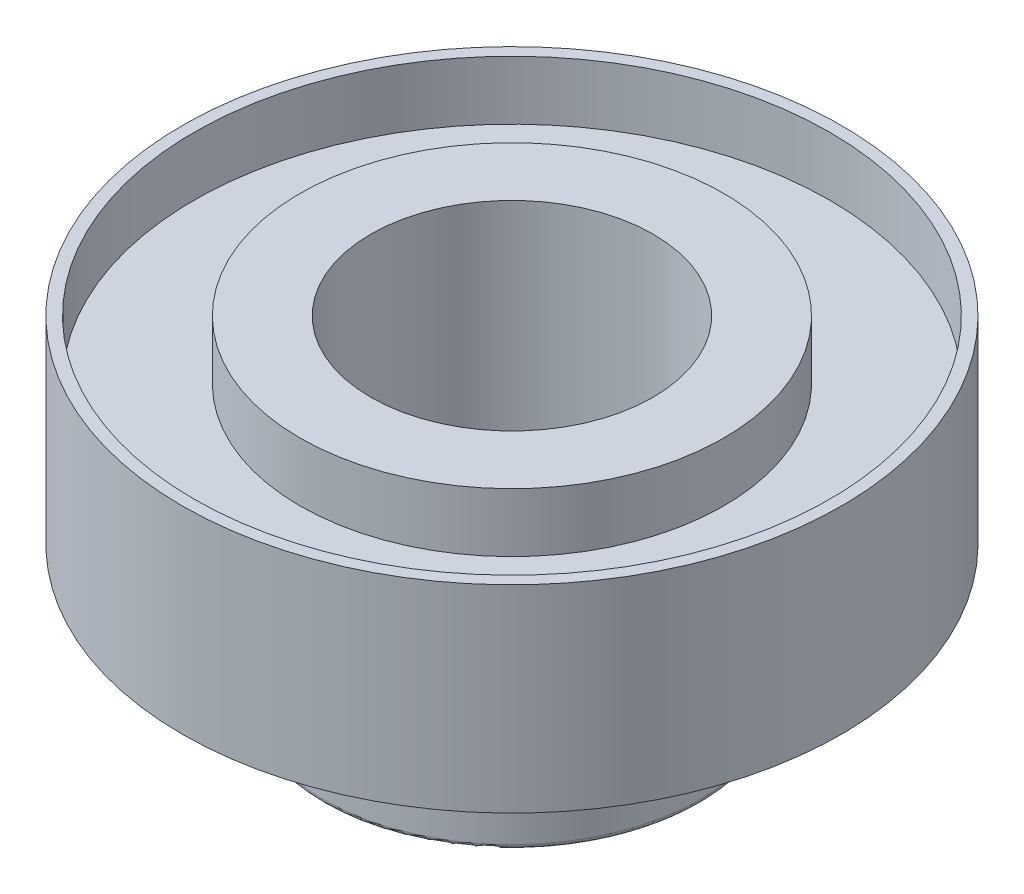
ISO-10303-21;
HEADER;
FILE_DESCRIPTION(('STEP AP214'),'2;1');
FILE_NAME('part.step','',(''),(''),'','','');
FILE_SCHEMA(('AUTOMOTIVE_DESIGN { 1 0 10303 214 1 1 1 1 }'));
ENDSEC;
DATA;
#1=APPLICATION_CONTEXT('core data for automotive mechanical design processes');
#2=APPLICATION_PROTOCOL_DEFINITION('international standard','automotive_design',2000,#1);
#3=PRODUCT_CONTEXT('',#1,'mechanical');
#4=PRODUCT('Part','Part','',(#3));
#5=PRODUCT_RELATED_PRODUCT_CATEGORY('part','',(#4));
#6=PRODUCT_DEFINITION_FORMATION('','',#4);
#7=PRODUCT_DEFINITION_CONTEXT('part definition',#1,'design');
#8=PRODUCT_DEFINITION('design','',#6,#7);
#9=PRODUCT_DEFINITION_SHAPE('','',#8);
#10=(LENGTH_UNIT() NAMED_UNIT(*) SI_UNIT(.MILLI.,.METRE.));
#11=(NAMED_UNIT(*) PLANE_ANGLE_UNIT() SI_UNIT($,.RADIAN.));
#12=(NAMED_UNIT(*) SI_UNIT($,.STERADIAN.) SOLID_ANGLE_UNIT());
#13=UNCERTAINTY_MEASURE_WITH_UNIT(LENGTH_MEASURE(1.E-05),#10,'distance_accuracy_value','');
#14=(GEOMETRIC_REPRESENTATION_CONTEXT(3) GLOBAL_UNCERTAINTY_ASSIGNED_CONTEXT((#13)) GLOBAL_UNIT_ASSIGNED_CONTEXT((#10,
#11,#12)) REPRESENTATION_CONTEXT('',''));
#15=CARTESIAN_POINT('',(0.,0.,0.));
#16=DIRECTION('',(0.,0.,1.));
#17=DIRECTION('',(1.,0.,0.));
#18=AXIS2_PLACEMENT_3D('',#15,#16,#17);
#19=CARTESIAN_POINT('',(0.,0.,0.));
#20=DIRECTION('',(0.,1.,0.));
#21=DIRECTION('',(0.,0.,1.));
#22=AXIS2_PLACEMENT_3D('',#19,#20,#21);
#23=PLANE('',#22);
#24=CARTESIAN_POINT('',(0.,0.,0.));
#25=DIRECTION('',(0.,1.,0.));
#26=DIRECTION('',(0.,0.,1.));
#27=AXIS2_PLACEMENT_3D('',#24,#25,#26);
#28=CIRCLE('',#27,7.);
#29=CARTESIAN_POINT('',(0.,0.,7.));
#30=VERTEX_POINT('',#29);
#31=EDGE_CURVE('E58',#30,#30,#28,.T.);
#32=ORIENTED_EDGE('',*,*,#31,.F.);
#33=EDGE_LOOP('',(#32));
#34=FACE_BOUND('',#33,.T.);
#35=CARTESIAN_POINT('',(0.,0.,0.));
#36=DIRECTION('',(0.,1.,0.));
#37=DIRECTION('',(0.,0.,1.));
#38=AXIS2_PLACEMENT_3D('',#35,#36,#37);
#39=CIRCLE('',#38,4.);
#40=CARTESIAN_POINT('',(0.,0.,4.));
#41=VERTEX_POINT('',#40);
#42=EDGE_CURVE('E50',#41,#41,#39,.F.);
#43=ORIENTED_EDGE('',*,*,#42,.F.);
#44=EDGE_LOOP('',(#43));
#45=FACE_BOUND('',#44,.T.);
#46=ADVANCED_FACE('F37',(#34,#45),#23,.F.);
#47=CARTESIAN_POINT('',(0.,4.2,0.));
#48=DIRECTION('',(0.,1.,0.));
#49=DIRECTION('',(0.,0.,1.));
#50=AXIS2_PLACEMENT_3D('',#47,#48,#49);
#51=PLANE('',#50);
#52=CARTESIAN_POINT('',(0.,4.2,0.));
#53=DIRECTION('',(0.,1.,0.));
#54=DIRECTION('',(0.,0.,1.));
#55=AXIS2_PLACEMENT_3D('',#52,#53,#54);
#56=CIRCLE('',#55,3.);
#57=CARTESIAN_POINT('',(0.,4.2,3.));
#58=VERTEX_POINT('',#57);
#59=EDGE_CURVE('E62',#58,#58,#56,.T.);
#60=ORIENTED_EDGE('',*,*,#59,.F.);
#61=EDGE_LOOP('',(#60));
#62=FACE_BOUND('',#61,.T.);
#63=CARTESIAN_POINT('',(0.,4.2,0.));
#64=DIRECTION('',(0.,1.,0.));
#65=DIRECTION('',(0.,0.,1.));
#66=AXIS2_PLACEMENT_3D('',#63,#64,#65);
#67=CIRCLE('',#66,4.5);
#68=CARTESIAN_POINT('',(0.,4.2,4.5));
#69=VERTEX_POINT('',#68);
#70=EDGE_CURVE('E78',#69,#69,#67,.T.);
#71=ORIENTED_EDGE('',*,*,#70,.T.);
#72=EDGE_LOOP('',(#71));
#73=FACE_BOUND('',#72,.T.);
#74=ADVANCED_FACE('F106',(#62,#73),#51,.T.);
#75=CARTESIAN_POINT('',(0.,4.2,0.));
#76=DIRECTION('',(0.,-1.,0.));
#77=DIRECTION('',(0.,0.,-1.));
#78=AXIS2_PLACEMENT_3D('',#75,#76,#77);
#79=CYLINDRICAL_SURFACE('',#78,7.);
#80=CARTESIAN_POINT('',(0.,4.2,0.));
#81=DIRECTION('',(0.,1.,0.));
#82=DIRECTION('',(0.,0.,1.));
#83=AXIS2_PLACEMENT_3D('',#80,#81,#82);
#84=CIRCLE('',#83,7.);
#85=CARTESIAN_POINT('',(0.,4.2,7.));
#86=VERTEX_POINT('',#85);
#87=EDGE_CURVE('E55',#86,#86,#84,.T.);
#88=ORIENTED_EDGE('',*,*,#87,.F.);
#89=EDGE_LOOP('',(#88));
#90=FACE_BOUND('',#89,.T.);
#91=ORIENTED_EDGE('',*,*,#31,.T.);
#92=EDGE_LOOP('',(#91));
#93=FACE_BOUND('',#92,.T.);
#94=ADVANCED_FACE('F112',(#90,#93),#79,.T.);
#95=CARTESIAN_POINT('',(0.,4.2,0.));
#96=DIRECTION('',(0.,1.,0.));
#97=DIRECTION('',(0.,0.,1.));
#98=AXIS2_PLACEMENT_3D('',#95,#96,#97);
#99=CIRCLE('',#98,6.75);
#100=CARTESIAN_POINT('',(0.,4.2,6.75));
#101=VERTEX_POINT('',#100);
#102=EDGE_CURVE('E70',#101,#101,#99,.T.);
#103=ORIENTED_EDGE('',*,*,#102,.F.);
#104=EDGE_LOOP('',(#103));
#105=FACE_BOUND('',#104,.T.);
#106=ORIENTED_EDGE('',*,*,#87,.T.);
#107=EDGE_LOOP('',(#106));
#108=FACE_BOUND('',#107,.T.);
#109=ADVANCED_FACE('F115',(#105,#108),#51,.T.);
#110=CARTESIAN_POINT('',(0.,0.,0.));
#111=DIRECTION('',(0.,1.,0.));
#112=DIRECTION('',(0.,0.,1.));
#113=AXIS2_PLACEMENT_3D('',#110,#111,#112);
#114=CYLINDRICAL_SURFACE('',#113,3.);
#115=ORIENTED_EDGE('',*,*,#59,.T.);
#116=EDGE_LOOP('',(#115));
#117=FACE_BOUND('',#116,.T.);
#118=CARTESIAN_POINT('',(0.,-2.8,0.));
#119=DIRECTION('',(0.,-1.,0.));
#120=DIRECTION('',(0.,0.,-1.));
#121=AXIS2_PLACEMENT_3D('',#118,#119,#120);
#122=CIRCLE('',#121,3.);
#123=CARTESIAN_POINT('',(0.,-2.8,-3.));
#124=VERTEX_POINT('',#123);
#125=EDGE_CURVE('E82',#124,#124,#122,.T.);
#126=ORIENTED_EDGE('',*,*,#125,.T.);
#127=EDGE_LOOP('',(#126));
#128=FACE_BOUND('',#127,.T.);
#129=ADVANCED_FACE('F90',(#117,#128),#114,.F.);
#130=CARTESIAN_POINT('',(0.,2.95,0.));
#131=DIRECTION('',(0.,1.,0.));
#132=DIRECTION('',(0.,0.,1.));
#133=AXIS2_PLACEMENT_3D('',#130,#131,#132);
#134=CYLINDRICAL_SURFACE('',#133,6.75);
#135=CARTESIAN_POINT('',(0.,2.95,0.));
#136=DIRECTION('',(0.,1.,0.));
#137=DIRECTION('',(0.,0.,1.));
#138=AXIS2_PLACEMENT_3D('',#135,#136,#137);
#139=CIRCLE('',#138,6.75);
#140=CARTESIAN_POINT('',(0.,2.95,6.75));
#141=VERTEX_POINT('',#140);
#142=EDGE_CURVE('E69',#141,#141,#139,.T.);
#143=ORIENTED_EDGE('',*,*,#142,.F.);
#144=EDGE_LOOP('',(#143));
#145=FACE_BOUND('',#144,.T.);
#146=ORIENTED_EDGE('',*,*,#102,.T.);
#147=EDGE_LOOP('',(#146));
#148=FACE_BOUND('',#147,.T.);
#149=ADVANCED_FACE('F131',(#145,#148),#134,.F.);
#150=CARTESIAN_POINT('',(0.,2.95,0.));
#151=DIRECTION('',(0.,1.,0.));
#152=DIRECTION('',(0.,0.,1.));
#153=AXIS2_PLACEMENT_3D('',#150,#151,#152);
#154=PLANE('',#153);
#155=CARTESIAN_POINT('',(0.,2.95,0.));
#156=DIRECTION('',(0.,1.,0.));
#157=DIRECTION('',(0.,0.,1.));
#158=AXIS2_PLACEMENT_3D('',#155,#156,#157);
#159=CIRCLE('',#158,4.5);
#160=CARTESIAN_POINT('',(0.,2.95,4.5));
#161=VERTEX_POINT('',#160);
#162=EDGE_CURVE('E74',#161,#161,#159,.T.);
#163=ORIENTED_EDGE('',*,*,#162,.F.);
#164=EDGE_LOOP('',(#163));
#165=FACE_BOUND('',#164,.T.);
#166=ORIENTED_EDGE('',*,*,#142,.T.);
#167=EDGE_LOOP('',(#166));
#168=FACE_BOUND('',#167,.T.);
#169=ADVANCED_FACE('F102',(#165,#168),#154,.T.);
#170=CARTESIAN_POINT('',(0.,2.95,0.));
#171=DIRECTION('',(0.,1.,0.));
#172=DIRECTION('',(0.,0.,1.));
#173=AXIS2_PLACEMENT_3D('',#170,#171,#172);
#174=CYLINDRICAL_SURFACE('',#173,4.5);
#175=ORIENTED_EDGE('',*,*,#162,.T.);
#176=EDGE_LOOP('',(#175));
#177=FACE_BOUND('',#176,.T.);
#178=ORIENTED_EDGE('',*,*,#70,.F.);
#179=EDGE_LOOP('',(#178));
#180=FACE_BOUND('',#179,.T.);
#181=ADVANCED_FACE('F95',(#177,#180),#174,.T.);
#182=CARTESIAN_POINT('',(0.,-2.8,0.));
#183=DIRECTION('',(0.,-1.,0.));
#184=DIRECTION('',(0.,0.,-1.));
#185=AXIS2_PLACEMENT_3D('',#182,#183,#184);
#186=PLANE('',#185);
#187=CARTESIAN_POINT('',(0.,-2.8,0.));
#188=DIRECTION('',(0.,-1.,0.));
#189=DIRECTION('',(0.,0.,-1.));
#190=AXIS2_PLACEMENT_3D('',#187,#188,#189);
#191=CIRCLE('',#190,3.9);
#192=CARTESIAN_POINT('',(0.,-2.8,-3.9));
#193=VERTEX_POINT('',#192);
#194=EDGE_CURVE('E45',#193,#193,#191,.T.);
#195=ORIENTED_EDGE('',*,*,#194,.T.);
#196=EDGE_LOOP('',(#195));
#197=FACE_BOUND('',#196,.T.);
#198=ORIENTED_EDGE('',*,*,#125,.F.);
#199=EDGE_LOOP('',(#198));
#200=FACE_BOUND('',#199,.T.);
#201=ADVANCED_FACE('F92',(#197,#200),#186,.T.);
#202=CARTESIAN_POINT('',(0.,-2.8,0.));
#203=DIRECTION('',(0.,1.,0.));
#204=DIRECTION('',(0.,0.,1.));
#205=AXIS2_PLACEMENT_3D('',#202,#203,#204);
#206=CYLINDRICAL_SURFACE('',#205,4.);
#207=CARTESIAN_POINT('',(0.,-2.7,0.));
#208=DIRECTION('',(0.,-1.,0.));
#209=DIRECTION('',(0.,0.,-1.));
#210=AXIS2_PLACEMENT_3D('',#207,#208,#209);
#211=CIRCLE('',#210,4.);
#212=CARTESIAN_POINT('',(0.,-2.7,-4.));
#213=VERTEX_POINT('',#212);
#214=EDGE_CURVE('E10',#213,#213,#211,.F.);
#215=ORIENTED_EDGE('',*,*,#214,.T.);
#216=EDGE_LOOP('',(#215));
#217=FACE_BOUND('',#216,.T.);
#218=ORIENTED_EDGE('',*,*,#42,.T.);
#219=EDGE_LOOP('',(#218));
#220=FACE_BOUND('',#219,.T.);
#221=ADVANCED_FACE('F94',(#217,#220),#206,.T.);
#222=CARTESIAN_POINT('',(0.,-2.7,0.));
#223=DIRECTION('',(0.,-1.,0.));
#224=DIRECTION('',(0.,0.,-1.));
#225=AXIS2_PLACEMENT_3D('',#222,#223,#224);
#226=TOROIDAL_SURFACE('',#225,3.9,0.1);
#227=ORIENTED_EDGE('',*,*,#214,.F.);
#228=EDGE_LOOP('',(#227));
#229=FACE_BOUND('',#228,.T.);
#230=ORIENTED_EDGE('',*,*,#194,.F.);
#231=EDGE_LOOP('',(#230));
#232=FACE_BOUND('',#231,.T.);
#233=ADVANCED_FACE('F39',(#229,#232),#226,.T.);
#234=CLOSED_SHELL('',(#46,#74,#94,#109,#129,#149,#169,#181,#201,#221,#233));
#235=MANIFOLD_SOLID_BREP('B2',#234);
#236=ADVANCED_BREP_SHAPE_REPRESENTATION('',(#18,#235),#14);
#237=SHAPE_DEFINITION_REPRESENTATION(#9,#236);
ENDSEC;
END-ISO-10303-21;
